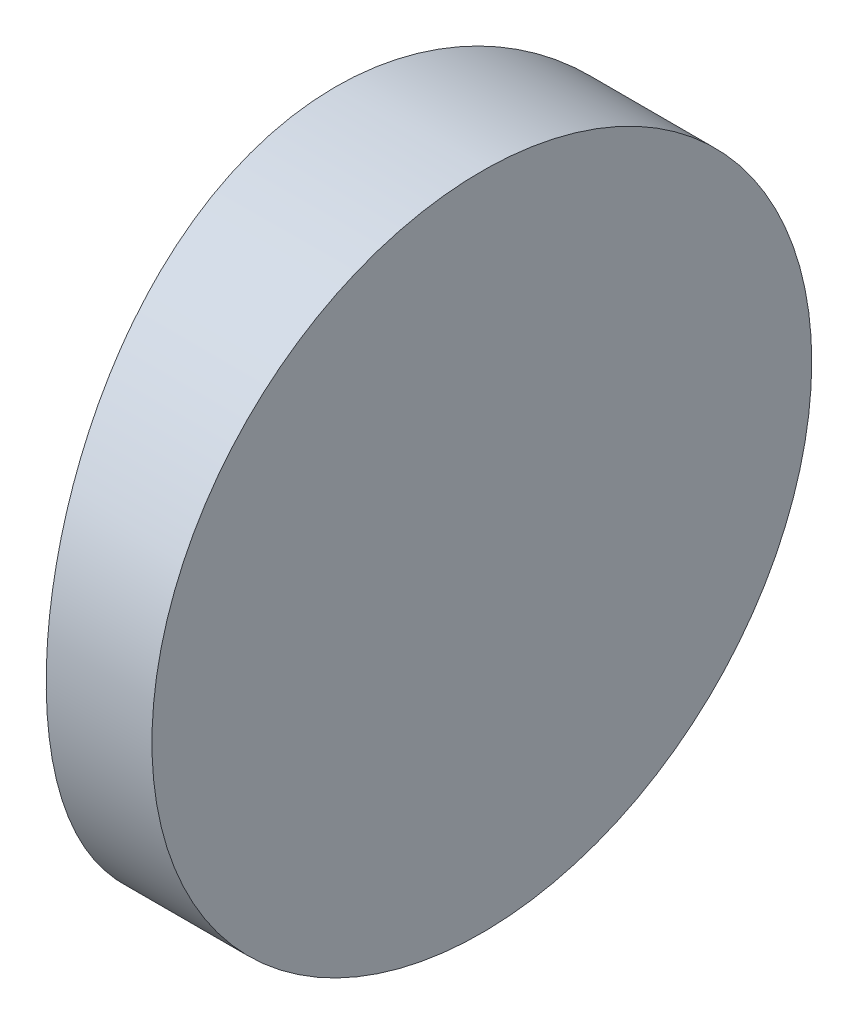
ISO-10303-21;
HEADER;
FILE_DESCRIPTION(('STEP AP214'),'2;1');
FILE_NAME('part.step','',(''),(''),'','','');
FILE_SCHEMA(('AUTOMOTIVE_DESIGN { 1 0 10303 214 1 1 1 1 }'));
ENDSEC;
DATA;
#1=APPLICATION_CONTEXT('core data for automotive mechanical design processes');
#2=APPLICATION_PROTOCOL_DEFINITION('international standard','automotive_design',2000,#1);
#3=PRODUCT_CONTEXT('',#1,'mechanical');
#4=PRODUCT('Part','Part','',(#3));
#5=PRODUCT_RELATED_PRODUCT_CATEGORY('part','',(#4));
#6=PRODUCT_DEFINITION_FORMATION('','',#4);
#7=PRODUCT_DEFINITION_CONTEXT('part definition',#1,'design');
#8=PRODUCT_DEFINITION('design','',#6,#7);
#9=PRODUCT_DEFINITION_SHAPE('','',#8);
#10=(LENGTH_UNIT() NAMED_UNIT(*) SI_UNIT(.MILLI.,.METRE.));
#11=(NAMED_UNIT(*) PLANE_ANGLE_UNIT() SI_UNIT($,.RADIAN.));
#12=(NAMED_UNIT(*) SI_UNIT($,.STERADIAN.) SOLID_ANGLE_UNIT());
#13=UNCERTAINTY_MEASURE_WITH_UNIT(LENGTH_MEASURE(1.E-05),#10,'distance_accuracy_value','');
#14=(GEOMETRIC_REPRESENTATION_CONTEXT(3) GLOBAL_UNCERTAINTY_ASSIGNED_CONTEXT((#13)) GLOBAL_UNIT_ASSIGNED_CONTEXT((#10,
#11,#12)) REPRESENTATION_CONTEXT('',''));
#15=CARTESIAN_POINT('',(0.,0.,0.));
#16=DIRECTION('',(0.,0.,1.));
#17=DIRECTION('',(1.,0.,0.));
#18=AXIS2_PLACEMENT_3D('',#15,#16,#17);
#19=CARTESIAN_POINT('',(4.35520433485127,12.5,0.));
#20=DIRECTION('',(0.,-1.,0.));
#21=DIRECTION('',(0.,0.,-1.));
#22=AXIS2_PLACEMENT_3D('',#19,#20,#21);
#23=CYLINDRICAL_SURFACE('',#22,25.85);
#24=CARTESIAN_POINT('',(-21.4947956651487,0.,0.));
#25=CARTESIAN_POINT('',(-21.4947971843653,-2.58926334076021E-06,-0.172845120667083));
#26=CARTESIAN_POINT('',(-21.4930588332287,0.0071728977027755,-0.345656083024528));
#27=CARTESIAN_POINT('',(-21.4861568051223,0.0358105609011541,-0.690075003225728));
#28=CARTESIAN_POINT('',(-21.4809924080525,0.057275740601251,-0.861682700497896));
#29=CARTESIAN_POINT('',(-21.4673745074225,0.114338520768345,-1.20251329306256));
#30=CARTESIAN_POINT('',(-21.4589187829067,0.149945664425557,-1.37173449790428));
#31=CARTESIAN_POINT('',(-21.4389494080932,0.235012423572454,-1.70653765976705));
#32=CARTESIAN_POINT('',(-21.4274346185392,0.284477200293397,-1.87211823601936));
#33=CARTESIAN_POINT('',(-21.4016837790659,0.396772851977055,-2.19815814204444));
#34=CARTESIAN_POINT('',(-21.3874523590281,0.459581006448642,-2.35862565060983));
#35=CARTESIAN_POINT('',(-21.3566432160334,0.598128704426552,-2.67366934958042));
#36=CARTESIAN_POINT('',(-21.3400646149442,0.673873089860318,-2.82824330748083));
#37=CARTESIAN_POINT('',(-21.2874772705965,0.919629427772968,-3.28138750818642));
#38=CARTESIAN_POINT('',(-21.2485856689764,1.10829507311223,-3.56975709425723));
#39=CARTESIAN_POINT('',(-21.1665286478647,1.53375863131345,-4.1160044432646));
#40=CARTESIAN_POINT('',(-21.1233008861928,1.77133340610462,-4.37326776941883));
#41=CARTESIAN_POINT('',(-21.0592575636715,2.15719851188058,-4.72673680493776));
#42=CARTESIAN_POINT('',(-21.0380285814674,2.29083900232968,-4.83922137750423));
#43=CARTESIAN_POINT('',(-20.9964213858493,2.5671273608113,-5.05266023943852));
#44=CARTESIAN_POINT('',(-20.9760428574759,2.70977184421474,-5.15361882185008));
#45=CARTESIAN_POINT('',(-20.9364220247145,3.0052940249185,-5.34469893329472));
#46=CARTESIAN_POINT('',(-20.9172006975891,3.15829087688967,-5.43464036669115));
#47=CARTESIAN_POINT('',(-20.8807979992301,3.47151196237933,-5.60124588231493));
#48=CARTESIAN_POINT('',(-20.8636158591412,3.63173344027957,-5.6779149737808));
#49=CARTESIAN_POINT('',(-20.8318152103069,3.95820751245558,-5.8173588455627));
#50=CARTESIAN_POINT('',(-20.8171945903362,4.12445500233121,-5.8801450795337));
#51=CARTESIAN_POINT('',(-20.7909520586818,4.46184989566587,-5.99137506931603));
#52=CARTESIAN_POINT('',(-20.7793294024424,4.63299607076468,-6.03982238669312));
#53=CARTESIAN_POINT('',(-20.7558246279714,5.04203149385095,-6.13694644958259));
#54=CARTESIAN_POINT('',(-20.7453880302804,5.28153897154851,-6.17928759167853));
#55=CARTESIAN_POINT('',(-20.731405863941,5.76405357853394,-6.23581204425391));
#56=CARTESIAN_POINT('',(-20.7278600558775,6.00706058593773,-6.2499963330224));
#57=CARTESIAN_POINT('',(-20.7278559890416,6.42276216311609,-6.2500026077077));
#58=CARTESIAN_POINT('',(-20.7296462466084,6.59549014362192,-6.2428339370449));
#59=CARTESIAN_POINT('',(-20.7367495170372,6.93974081063441,-6.2142241774124));
#60=CARTESIAN_POINT('',(-20.7420632728898,7.11126323521791,-6.19278007821812));
#61=CARTESIAN_POINT('',(-20.7560605030759,7.45192128761121,-6.13577497275599));
#62=CARTESIAN_POINT('',(-20.7647462819555,7.62105520093215,-6.10020431157119));
#63=CARTESIAN_POINT('',(-20.7852301499689,7.95568179899618,-6.01522756020206));
#64=CARTESIAN_POINT('',(-20.7970294023761,8.12117309767468,-5.96581629839029));
#65=CARTESIAN_POINT('',(-20.8233697877882,8.44702305557325,-5.85364985658405));
#66=CARTESIAN_POINT('',(-20.8379060314623,8.6073902798501,-5.79091844641658));
#67=CARTESIAN_POINT('',(-20.8693131472836,8.92224170479603,-5.65254266149246));
#68=CARTESIAN_POINT('',(-20.8861848938103,9.07672367435612,-5.57689344800186));
#69=CARTESIAN_POINT('',(-20.9395839948348,9.5296164660288,-5.331445027396));
#70=CARTESIAN_POINT('',(-20.9789270827197,9.81784776292964,-5.14301578660555));
#71=CARTESIAN_POINT('',(-21.061569538438,10.3642367515891,-4.71779644507374));
#72=CARTESIAN_POINT('',(-21.1049286282,10.6217395009364,-4.48017622583903));
#73=CARTESIAN_POINT('',(-21.1688510221462,10.9755583002418,-4.09416697558011));
#74=CARTESIAN_POINT('',(-21.1899863889303,11.0881572913047,-3.96046676040585));
#75=CARTESIAN_POINT('',(-21.2313131969069,11.301816881341,-3.684035243988));
#76=CARTESIAN_POINT('',(-21.2515049893383,11.4028817943265,-3.5413073505546));
#77=CARTESIAN_POINT('',(-21.2906603285715,11.5940864459252,-3.24571437562487));
#78=CARTESIAN_POINT('',(-21.3096030284657,11.6840557725586,-3.09273640243058));
#79=CARTESIAN_POINT('',(-21.3454071401066,11.850718916157,-2.7795499986352));
#80=CARTESIAN_POINT('',(-21.3622693361516,11.9274177401849,-2.61934432399269));
#81=CARTESIAN_POINT('',(-21.3934258003482,12.0669217710987,-2.29290151986354));
#82=CARTESIAN_POINT('',(-21.4077221532634,12.129738267152,-2.12666942011025));
#83=CARTESIAN_POINT('',(-21.4333493205642,12.2410285569654,-1.78931002357878));
#84=CARTESIAN_POINT('',(-21.4446808652318,12.2895058830879,-1.61818394381186));
#85=CARTESIAN_POINT('',(-21.4675910442367,12.3867576549377,-1.20897099117597));
#86=CARTESIAN_POINT('',(-21.4777474515453,12.4291700462861,-0.969261716118891));
#87=CARTESIAN_POINT('',(-21.4913485888429,12.4857889579791,-0.486345690714723));
#88=CARTESIAN_POINT('',(-21.494793528086,12.4999963577159,-0.243139049648761));
#89=CARTESIAN_POINT('',(-21.4947971843653,12.5000025892633,0.172845120667085));
#90=CARTESIAN_POINT('',(-21.4930588332287,12.4928271022972,0.345656083024529));
#91=CARTESIAN_POINT('',(-21.4861568051223,12.4641894390988,0.69007500322573));
#92=CARTESIAN_POINT('',(-21.4809924080525,12.4427242593987,0.861682700497899));
#93=CARTESIAN_POINT('',(-21.4673745074225,12.3856614792317,1.20251329306257));
#94=CARTESIAN_POINT('',(-21.4589187829067,12.3500543355744,1.37173449790428));
#95=CARTESIAN_POINT('',(-21.4389494080932,12.2649875764275,1.70653765976705));
#96=CARTESIAN_POINT('',(-21.4274346185392,12.2155227997066,1.87211823601936));
#97=CARTESIAN_POINT('',(-21.4016837790659,12.1032271480229,2.19815814204444));
#98=CARTESIAN_POINT('',(-21.3874523590281,12.0404189935514,2.35862565060983));
#99=CARTESIAN_POINT('',(-21.3566432160334,11.9018712955734,2.67366934958042));
#100=CARTESIAN_POINT('',(-21.3400646149442,11.8261269101397,2.82824330748083));
#101=CARTESIAN_POINT('',(-21.2874772705965,11.580370572227,3.28138750818642));
#102=CARTESIAN_POINT('',(-21.2485856689764,11.3917049268878,3.56975709425723));
#103=CARTESIAN_POINT('',(-21.1665286478647,10.9662413686866,4.1160044432646));
#104=CARTESIAN_POINT('',(-21.1233008861928,10.7286665938954,4.37326776941883));
#105=CARTESIAN_POINT('',(-21.0592575636715,10.3428014881194,4.72673680493776));
#106=CARTESIAN_POINT('',(-21.0380285814674,10.2091609976703,4.83922137750423));
#107=CARTESIAN_POINT('',(-20.9964213858493,9.9328726391887,5.05266023943852));
#108=CARTESIAN_POINT('',(-20.9760428574759,9.79022815578527,5.15361882185008));
#109=CARTESIAN_POINT('',(-20.9364220247145,9.49470597508151,5.34469893329472));
#110=CARTESIAN_POINT('',(-20.9172006975891,9.34170912311033,5.43464036669115));
#111=CARTESIAN_POINT('',(-20.8807979992301,9.02848803762067,5.60124588231493));
#112=CARTESIAN_POINT('',(-20.8636158591412,8.86826655972044,5.6779149737808));
#113=CARTESIAN_POINT('',(-20.8318152103069,8.54179248754443,5.81735884556269));
#114=CARTESIAN_POINT('',(-20.8171945903362,8.3755449976688,5.8801450795337));
#115=CARTESIAN_POINT('',(-20.7909520586818,8.03815010433414,5.99137506931603));
#116=CARTESIAN_POINT('',(-20.7793294024424,7.86700392923532,6.03982238669312));
#117=CARTESIAN_POINT('',(-20.7558246279714,7.45796850614906,6.13694644958259));
#118=CARTESIAN_POINT('',(-20.7453880302804,7.21846102845149,6.17928759167853));
#119=CARTESIAN_POINT('',(-20.731405863941,6.73594642146606,6.23581204425391));
#120=CARTESIAN_POINT('',(-20.7278600558775,6.49293941406228,6.24999633302241));
#121=CARTESIAN_POINT('',(-20.7278559890416,6.07723783688391,6.2500026077077));
#122=CARTESIAN_POINT('',(-20.7296462466084,5.90450985637808,6.2428339370449));
#123=CARTESIAN_POINT('',(-20.7367495170372,5.56025918936559,6.2142241774124));
#124=CARTESIAN_POINT('',(-20.7420632728898,5.38873676478209,6.19278007821812));
#125=CARTESIAN_POINT('',(-20.7560605030759,5.04807871238879,6.13577497275599));
#126=CARTESIAN_POINT('',(-20.7647462819555,4.87894479906784,6.10020431157119));
#127=CARTESIAN_POINT('',(-20.7852301499689,4.54431820100382,6.01522756020206));
#128=CARTESIAN_POINT('',(-20.7970294023761,4.37882690232532,5.96581629839029));
#129=CARTESIAN_POINT('',(-20.8233697877882,4.05297694442675,5.85364985658405));
#130=CARTESIAN_POINT('',(-20.8379060314623,3.8926097201499,5.79091844641658));
#131=CARTESIAN_POINT('',(-20.8693131472836,3.57775829520397,5.65254266149246));
#132=CARTESIAN_POINT('',(-20.8861848938103,3.42327632564387,5.57689344800186));
#133=CARTESIAN_POINT('',(-20.9395839948348,2.9703835339712,5.33144502739601));
#134=CARTESIAN_POINT('',(-20.9789270827197,2.68215223707036,5.14301578660556));
#135=CARTESIAN_POINT('',(-21.061569538438,2.13576324841095,4.71779644507374));
#136=CARTESIAN_POINT('',(-21.1049286282,1.87826049906357,4.48017622583903));
#137=CARTESIAN_POINT('',(-21.1688510221462,1.52444169975816,4.09416697558011));
#138=CARTESIAN_POINT('',(-21.1899863889303,1.41184270869529,3.96046676040585));
#139=CARTESIAN_POINT('',(-21.2313131969069,1.19818311865904,3.684035243988));
#140=CARTESIAN_POINT('',(-21.2515049893383,1.09711820567348,3.5413073505546));
#141=CARTESIAN_POINT('',(-21.2906603285715,0.905913554074834,3.24571437562487));
#142=CARTESIAN_POINT('',(-21.3096030284657,0.81594422744138,3.09273640243059));
#143=CARTESIAN_POINT('',(-21.3454071401066,0.649281083843024,2.77954999863521));
#144=CARTESIAN_POINT('',(-21.3622693361516,0.572582259815093,2.6193443239927));
#145=CARTESIAN_POINT('',(-21.3934258003482,0.43307822890128,2.29290151986354));
#146=CARTESIAN_POINT('',(-21.4077221532634,0.370261732847964,2.12666942011025));
#147=CARTESIAN_POINT('',(-21.4333493205642,0.258971443034598,1.78931002357878));
#148=CARTESIAN_POINT('',(-21.4446808652318,0.210494116912087,1.61818394381186));
#149=CARTESIAN_POINT('',(-21.4675910442367,0.113242345062311,1.20897099117597));
#150=CARTESIAN_POINT('',(-21.4777474515453,0.0708299537139019,0.969261716118892));
#151=CARTESIAN_POINT('',(-21.4913485888429,0.0142110420208622,0.486345690714725));
#152=CARTESIAN_POINT('',(-21.494793528086,3.64228406062664E-06,0.243139049648763));
#153=CARTESIAN_POINT('',(-21.4947956651487,0.,0.));
#154=B_SPLINE_CURVE_WITH_KNOTS('',3,(#24,#25,#26,#27,#28,#29,#30,#31,#32,#33,#34,#35,#36,#37,
#38,#39,#40,#41,#42,#43,#44,#45,#46,#47,#48,#49,#50,#51,#52,#53,#54,#55,#56,#57,#58,#59,#60,#61,
#62,#63,#64,#65,#66,#67,#68,#69,#70,#71,#72,#73,#74,#75,#76,#77,#78,#79,#80,#81,#82,#83,#84,#85,
#86,#87,#88,#89,#90,#91,#92,#93,#94,#95,#96,#97,#98,#99,#100,#101,#102,#103,#104,#105,#106,#107,
#108,#109,#110,#111,#112,#113,#114,#115,#116,#117,#118,#119,#120,#121,#122,#123,#124,#125,#126,
#127,#128,#129,#130,#131,#132,#133,#134,#135,#136,#137,#138,#139,#140,#141,#142,#143,#144,#145,
#146,#147,#148,#149,#150,#151,#152,#153),.UNSPECIFIED.,.T.,.F.,(4,2,2,2,2,2,2,2,2,2,2,2,2,2,2,2,
2,2,2,2,2,2,2,2,2,2,2,2,2,2,2,2,2,2,2,2,2,2,2,2,2,2,2,2,2,2,2,2,2,2,2,2,2,2,2,2,2,2,2,2,2,2,2,2,
4),(0.,0.518319122106348,1.03674722112053,1.5555257585196,2.0744977707926,2.59259308433446,
3.11088274349189,4.14627634581502,5.1995981721161,5.72698177718215,6.25416830426745,
6.789065302714,7.32375997845027,7.85801185986533,8.39213092977108,9.12066994313736,
9.84918364351101,10.3672535632153,10.8854327616708,11.4039667252009,11.9226947012613,
12.440504671111,12.9585090287342,13.9933426363421,15.0473189778229,15.5750227860712,
16.1025285695083,16.6373292290351,17.1719276620165,17.7060897443985,18.2401201295808,
18.9692558303841,19.6983687973995,20.2166879195059,20.7351160185201,21.2538945559191,
21.7728665681921,22.290961881734,22.8092515408914,23.8446451432145,24.8979669695156,
25.4253505745817,25.952537101667,26.4874341001135,27.0221287758498,27.5563806572648,
28.0904997271706,28.8190387405369,29.5475524409105,30.0656223606149,30.5838015590703,
31.1023355226005,31.6210634986609,32.1388734685105,32.6568778261338,33.6917114337416,
34.7456877752224,35.2733915834707,35.8008973669079,36.3356980264347,36.870296459416,
37.404458541798,37.9384889269803,38.6676246277836,39.3967375947991),.UNSPECIFIED.);
#155=CARTESIAN_POINT('',(-21.4947956651487,0.,0.));
#156=VERTEX_POINT('',#155);
#157=EDGE_CURVE('E10',#156,#156,#154,.T.);
#158=ORIENTED_EDGE('',*,*,#157,.F.);
#159=EDGE_LOOP('',(#158));
#160=FACE_BOUND('',#159,.T.);
#161=ADVANCED_FACE('F33',(#160),#23,.T.);
#162=CARTESIAN_POINT('',(-18.7247956651487,12.5,-6.24999999999999));
#163=DIRECTION('',(1.,0.,0.));
#164=DIRECTION('',(0.,0.,-1.));
#165=AXIS2_PLACEMENT_3D('',#162,#163,#164);
#166=PLANE('',#165);
#167=CARTESIAN_POINT('',(-18.7247956651487,6.25,0.));
#168=DIRECTION('',(1.,0.,0.));
#169=DIRECTION('',(0.,0.,-1.));
#170=AXIS2_PLACEMENT_3D('',#167,#168,#169);
#171=CIRCLE('',#170,6.25);
#172=CARTESIAN_POINT('',(-18.7247956651487,6.25,-6.25));
#173=VERTEX_POINT('',#172);
#174=EDGE_CURVE('E43',#173,#173,#171,.T.);
#175=ORIENTED_EDGE('',*,*,#174,.T.);
#176=EDGE_LOOP('',(#175));
#177=FACE_BOUND('',#176,.T.);
#178=ADVANCED_FACE('F35',(#177),#166,.T.);
#179=CARTESIAN_POINT('',(-31.4247956651487,6.25,0.));
#180=DIRECTION('',(1.,0.,0.));
#181=DIRECTION('',(0.,0.,-1.));
#182=AXIS2_PLACEMENT_3D('',#179,#180,#181);
#183=CYLINDRICAL_SURFACE('',#182,6.25);
#184=ORIENTED_EDGE('',*,*,#174,.F.);
#185=EDGE_LOOP('',(#184));
#186=FACE_BOUND('',#185,.T.);
#187=ORIENTED_EDGE('',*,*,#157,.T.);
#188=EDGE_LOOP('',(#187));
#189=FACE_BOUND('',#188,.T.);
#190=ADVANCED_FACE('F50',(#186,#189),#183,.T.);
#191=CLOSED_SHELL('',(#161,#178,#190));
#192=MANIFOLD_SOLID_BREP('B2',#191);
#193=ADVANCED_BREP_SHAPE_REPRESENTATION('',(#18,#192),#14);
#194=SHAPE_DEFINITION_REPRESENTATION(#9,#193);
ENDSEC;
END-ISO-10303-21;
